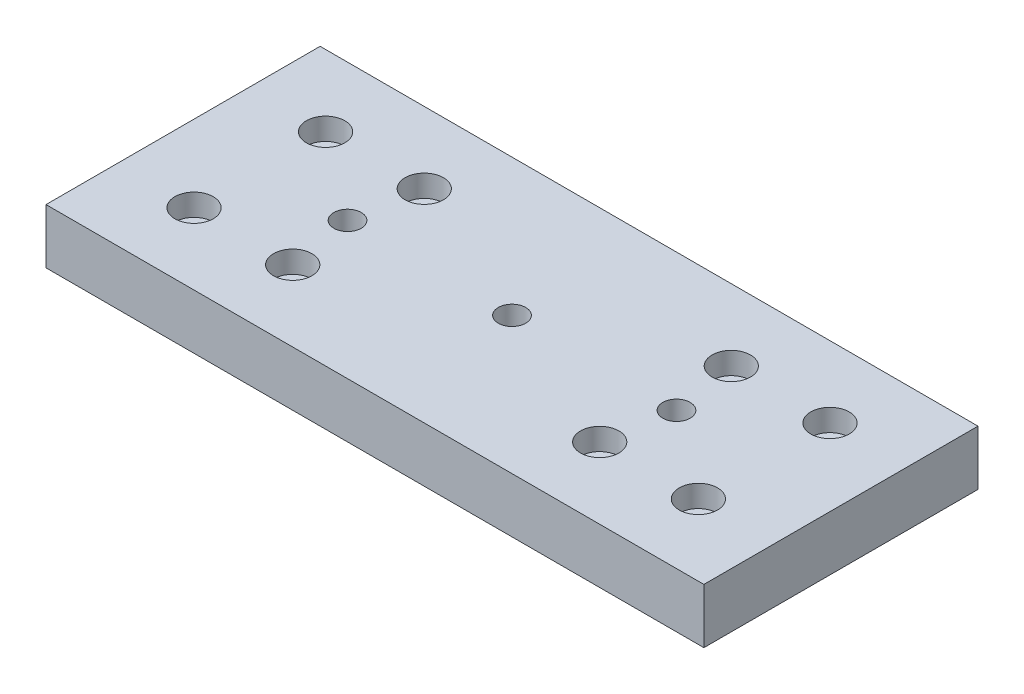
ISO-10303-21;
HEADER;
FILE_DESCRIPTION(('STEP AP214'),'2;1');
FILE_NAME('part.step','',(''),(''),'','','');
FILE_SCHEMA(('AUTOMOTIVE_DESIGN { 1 0 10303 214 1 1 1 1 }'));
ENDSEC;
DATA;
#1=APPLICATION_CONTEXT('core data for automotive mechanical design processes');
#2=APPLICATION_PROTOCOL_DEFINITION('international standard','automotive_design',2000,#1);
#3=PRODUCT_CONTEXT('',#1,'mechanical');
#4=PRODUCT('Part','Part','',(#3));
#5=PRODUCT_RELATED_PRODUCT_CATEGORY('part','',(#4));
#6=PRODUCT_DEFINITION_FORMATION('','',#4);
#7=PRODUCT_DEFINITION_CONTEXT('part definition',#1,'design');
#8=PRODUCT_DEFINITION('design','',#6,#7);
#9=PRODUCT_DEFINITION_SHAPE('','',#8);
#10=(LENGTH_UNIT() NAMED_UNIT(*) SI_UNIT(.MILLI.,.METRE.));
#11=(NAMED_UNIT(*) PLANE_ANGLE_UNIT() SI_UNIT($,.RADIAN.));
#12=(NAMED_UNIT(*) SI_UNIT($,.STERADIAN.) SOLID_ANGLE_UNIT());
#13=UNCERTAINTY_MEASURE_WITH_UNIT(LENGTH_MEASURE(1.E-05),#10,'distance_accuracy_value','');
#14=(GEOMETRIC_REPRESENTATION_CONTEXT(3) GLOBAL_UNCERTAINTY_ASSIGNED_CONTEXT((#13)) GLOBAL_UNIT_ASSIGNED_CONTEXT((#10,
#11,#12)) REPRESENTATION_CONTEXT('',''));
#15=CARTESIAN_POINT('',(0.,0.,0.));
#16=DIRECTION('',(0.,0.,1.));
#17=DIRECTION('',(1.,0.,0.));
#18=AXIS2_PLACEMENT_3D('',#15,#16,#17);
#19=CARTESIAN_POINT('',(-45.9999999999994,0.,-11.9999999999998));
#20=DIRECTION('',(0.,1.,0.));
#21=DIRECTION('',(0.,0.,1.));
#22=AXIS2_PLACEMENT_3D('',#19,#20,#21);
#23=CYLINDRICAL_SURFACE('',#22,1.5);
#24=CARTESIAN_POINT('',(-45.9999999999994,0.,-11.9999999999998));
#25=DIRECTION('',(0.,1.,0.));
#26=DIRECTION('',(0.,0.,1.));
#27=AXIS2_PLACEMENT_3D('',#24,#25,#26);
#28=CIRCLE('',#27,1.5);
#29=CARTESIAN_POINT('',(-45.9999999999994,0.,-10.4999999999998));
#30=VERTEX_POINT('',#29);
#31=EDGE_CURVE('E171',#30,#30,#28,.T.);
#32=ORIENTED_EDGE('',*,*,#31,.F.);
#33=EDGE_LOOP('',(#32));
#34=FACE_BOUND('',#33,.T.);
#35=CARTESIAN_POINT('',(-45.9999999999994,6.,-11.9999999999998));
#36=DIRECTION('',(0.,1.,0.));
#37=DIRECTION('',(0.,0.,1.));
#38=AXIS2_PLACEMENT_3D('',#35,#36,#37);
#39=CIRCLE('',#38,1.5);
#40=CARTESIAN_POINT('',(-45.9999999999994,6.,-10.4999999999998));
#41=VERTEX_POINT('',#40);
#42=EDGE_CURVE('E141',#41,#41,#39,.F.);
#43=ORIENTED_EDGE('',*,*,#42,.F.);
#44=EDGE_LOOP('',(#43));
#45=FACE_BOUND('',#44,.T.);
#46=ADVANCED_FACE('F36',(#34,#45),#23,.F.);
#47=CARTESIAN_POINT('',(-27.9999999999994,0.,-11.9999999999998));
#48=DIRECTION('',(0.,1.,0.));
#49=DIRECTION('',(0.,0.,1.));
#50=AXIS2_PLACEMENT_3D('',#47,#48,#49);
#51=CYLINDRICAL_SURFACE('',#50,1.5);
#52=CARTESIAN_POINT('',(-27.9999999999994,0.,-11.9999999999998));
#53=DIRECTION('',(0.,1.,0.));
#54=DIRECTION('',(0.,0.,1.));
#55=AXIS2_PLACEMENT_3D('',#52,#53,#54);
#56=CIRCLE('',#55,1.5);
#57=CARTESIAN_POINT('',(-27.9999999999994,0.,-10.4999999999998));
#58=VERTEX_POINT('',#57);
#59=EDGE_CURVE('E167',#58,#58,#56,.T.);
#60=ORIENTED_EDGE('',*,*,#59,.F.);
#61=EDGE_LOOP('',(#60));
#62=FACE_BOUND('',#61,.T.);
#63=CARTESIAN_POINT('',(-27.9999999999994,6.,-11.9999999999998));
#64=DIRECTION('',(0.,1.,0.));
#65=DIRECTION('',(0.,0.,1.));
#66=AXIS2_PLACEMENT_3D('',#63,#64,#65);
#67=CIRCLE('',#66,1.5);
#68=CARTESIAN_POINT('',(-27.9999999999994,6.,-10.4999999999998));
#69=VERTEX_POINT('',#68);
#70=EDGE_CURVE('E136',#69,#69,#67,.F.);
#71=ORIENTED_EDGE('',*,*,#70,.F.);
#72=EDGE_LOOP('',(#71));
#73=FACE_BOUND('',#72,.T.);
#74=ADVANCED_FACE('F211',(#62,#73),#51,.F.);
#75=CARTESIAN_POINT('',(45.9999999999994,0.,11.9999999999999));
#76=DIRECTION('',(0.,1.,0.));
#77=DIRECTION('',(0.,0.,1.));
#78=AXIS2_PLACEMENT_3D('',#75,#76,#77);
#79=CYLINDRICAL_SURFACE('',#78,1.5);
#80=CARTESIAN_POINT('',(45.9999999999994,0.,11.9999999999999));
#81=DIRECTION('',(0.,1.,0.));
#82=DIRECTION('',(0.,0.,1.));
#83=AXIS2_PLACEMENT_3D('',#80,#81,#82);
#84=CIRCLE('',#83,1.5);
#85=CARTESIAN_POINT('',(45.9999999999994,0.,13.4999999999998));
#86=VERTEX_POINT('',#85);
#87=EDGE_CURVE('E183',#86,#86,#84,.T.);
#88=ORIENTED_EDGE('',*,*,#87,.F.);
#89=EDGE_LOOP('',(#88));
#90=FACE_BOUND('',#89,.T.);
#91=CARTESIAN_POINT('',(45.9999999999994,6.,11.9999999999999));
#92=DIRECTION('',(0.,1.,0.));
#93=DIRECTION('',(0.,0.,1.));
#94=AXIS2_PLACEMENT_3D('',#91,#92,#93);
#95=CIRCLE('',#94,1.5);
#96=CARTESIAN_POINT('',(45.9999999999994,6.,13.4999999999998));
#97=VERTEX_POINT('',#96);
#98=EDGE_CURVE('E130',#97,#97,#95,.F.);
#99=ORIENTED_EDGE('',*,*,#98,.F.);
#100=EDGE_LOOP('',(#99));
#101=FACE_BOUND('',#100,.T.);
#102=ADVANCED_FACE('F218',(#90,#101),#79,.F.);
#103=CARTESIAN_POINT('',(27.9999999999994,0.,11.9999999999999));
#104=DIRECTION('',(0.,1.,0.));
#105=DIRECTION('',(0.,0.,1.));
#106=AXIS2_PLACEMENT_3D('',#103,#104,#105);
#107=CYLINDRICAL_SURFACE('',#106,1.5);
#108=CARTESIAN_POINT('',(27.9999999999994,0.,11.9999999999999));
#109=DIRECTION('',(0.,1.,0.));
#110=DIRECTION('',(0.,0.,1.));
#111=AXIS2_PLACEMENT_3D('',#108,#109,#110);
#112=CIRCLE('',#111,1.5);
#113=CARTESIAN_POINT('',(27.9999999999994,0.,13.4999999999999));
#114=VERTEX_POINT('',#113);
#115=EDGE_CURVE('E180',#114,#114,#112,.T.);
#116=ORIENTED_EDGE('',*,*,#115,.F.);
#117=EDGE_LOOP('',(#116));
#118=FACE_BOUND('',#117,.T.);
#119=CARTESIAN_POINT('',(27.9999999999994,6.,11.9999999999999));
#120=DIRECTION('',(0.,1.,0.));
#121=DIRECTION('',(0.,0.,1.));
#122=AXIS2_PLACEMENT_3D('',#119,#120,#121);
#123=CIRCLE('',#122,1.5);
#124=CARTESIAN_POINT('',(27.9999999999994,6.,13.4999999999999));
#125=VERTEX_POINT('',#124);
#126=EDGE_CURVE('E126',#125,#125,#123,.F.);
#127=ORIENTED_EDGE('',*,*,#126,.F.);
#128=EDGE_LOOP('',(#127));
#129=FACE_BOUND('',#128,.T.);
#130=ADVANCED_FACE('F230',(#118,#129),#107,.F.);
#131=CARTESIAN_POINT('',(0.,10.,0.));
#132=DIRECTION('',(0.,-1.,0.));
#133=DIRECTION('',(0.,0.,-1.));
#134=AXIS2_PLACEMENT_3D('',#131,#132,#133);
#135=CYLINDRICAL_SURFACE('',#134,2.5);
#136=CARTESIAN_POINT('',(0.,10.,0.));
#137=DIRECTION('',(0.,-1.,0.));
#138=DIRECTION('',(0.,0.,-1.));
#139=AXIS2_PLACEMENT_3D('',#136,#137,#138);
#140=CIRCLE('',#139,2.5);
#141=CARTESIAN_POINT('',(0.,10.,-2.5));
#142=VERTEX_POINT('',#141);
#143=EDGE_CURVE('E162',#142,#142,#140,.T.);
#144=ORIENTED_EDGE('',*,*,#143,.F.);
#145=EDGE_LOOP('',(#144));
#146=FACE_BOUND('',#145,.T.);
#147=CARTESIAN_POINT('',(0.,5.,0.));
#148=DIRECTION('',(0.,-1.,0.));
#149=DIRECTION('',(0.,0.,-1.));
#150=AXIS2_PLACEMENT_3D('',#147,#148,#149);
#151=CIRCLE('',#150,2.5);
#152=CARTESIAN_POINT('',(0.,5.,-2.5));
#153=VERTEX_POINT('',#152);
#154=EDGE_CURVE('E119',#153,#153,#151,.F.);
#155=ORIENTED_EDGE('',*,*,#154,.F.);
#156=EDGE_LOOP('',(#155));
#157=FACE_BOUND('',#156,.T.);
#158=ADVANCED_FACE('F233',(#146,#157),#135,.F.);
#159=CARTESIAN_POINT('',(29.9999999999984,10.,0.));
#160=DIRECTION('',(0.,-1.,0.));
#161=DIRECTION('',(0.,0.,-1.));
#162=AXIS2_PLACEMENT_3D('',#159,#160,#161);
#163=CYLINDRICAL_SURFACE('',#162,2.5);
#164=CARTESIAN_POINT('',(29.9999999999984,10.,0.));
#165=DIRECTION('',(0.,-1.,0.));
#166=DIRECTION('',(0.,0.,-1.));
#167=AXIS2_PLACEMENT_3D('',#164,#165,#166);
#168=CIRCLE('',#167,2.5);
#169=CARTESIAN_POINT('',(29.9999999999984,10.,-2.5));
#170=VERTEX_POINT('',#169);
#171=EDGE_CURVE('E159',#170,#170,#168,.T.);
#172=ORIENTED_EDGE('',*,*,#171,.F.);
#173=EDGE_LOOP('',(#172));
#174=FACE_BOUND('',#173,.T.);
#175=CARTESIAN_POINT('',(29.9999999999984,5.,0.));
#176=DIRECTION('',(0.,-1.,0.));
#177=DIRECTION('',(0.,0.,-1.));
#178=AXIS2_PLACEMENT_3D('',#175,#176,#177);
#179=CIRCLE('',#178,2.5);
#180=CARTESIAN_POINT('',(29.9999999999984,5.,-2.5));
#181=VERTEX_POINT('',#180);
#182=EDGE_CURVE('E115',#181,#181,#179,.F.);
#183=ORIENTED_EDGE('',*,*,#182,.F.);
#184=EDGE_LOOP('',(#183));
#185=FACE_BOUND('',#184,.T.);
#186=ADVANCED_FACE('F316',(#174,#185),#163,.F.);
#187=CARTESIAN_POINT('',(-30.,10.,0.));
#188=DIRECTION('',(0.,-1.,0.));
#189=DIRECTION('',(0.,0.,-1.));
#190=AXIS2_PLACEMENT_3D('',#187,#188,#189);
#191=CYLINDRICAL_SURFACE('',#190,2.5);
#192=CARTESIAN_POINT('',(-30.,10.,0.));
#193=DIRECTION('',(0.,-1.,0.));
#194=DIRECTION('',(0.,0.,-1.));
#195=AXIS2_PLACEMENT_3D('',#192,#193,#194);
#196=CIRCLE('',#195,2.5);
#197=CARTESIAN_POINT('',(-30.,10.,-2.5));
#198=VERTEX_POINT('',#197);
#199=EDGE_CURVE('E122',#198,#198,#196,.T.);
#200=ORIENTED_EDGE('',*,*,#199,.F.);
#201=EDGE_LOOP('',(#200));
#202=FACE_BOUND('',#201,.T.);
#203=CARTESIAN_POINT('',(-30.,5.,0.));
#204=DIRECTION('',(0.,-1.,0.));
#205=DIRECTION('',(0.,0.,-1.));
#206=AXIS2_PLACEMENT_3D('',#203,#204,#205);
#207=CIRCLE('',#206,2.5);
#208=CARTESIAN_POINT('',(-30.,5.,-2.5));
#209=VERTEX_POINT('',#208);
#210=EDGE_CURVE('E112',#209,#209,#207,.F.);
#211=ORIENTED_EDGE('',*,*,#210,.F.);
#212=EDGE_LOOP('',(#211));
#213=FACE_BOUND('',#212,.T.);
#214=ADVANCED_FACE('F319',(#202,#213),#191,.F.);
#215=CARTESIAN_POINT('',(-60.,10.,25.));
#216=DIRECTION('',(1.,0.,0.));
#217=DIRECTION('',(0.,0.,-1.));
#218=AXIS2_PLACEMENT_3D('',#215,#216,#217);
#219=PLANE('',#218);
#220=DIRECTION('',(0.,0.,1.));
#221=VECTOR('',#220,1.);
#222=CARTESIAN_POINT('',(-60.,0.,25.));
#223=LINE('',#222,#221);
#224=CARTESIAN_POINT('',(-60.,0.,-25.));
#225=VERTEX_POINT('',#224);
#226=CARTESIAN_POINT('',(-60.,0.,25.));
#227=VERTEX_POINT('',#226);
#228=EDGE_CURVE('E103',#225,#227,#223,.T.);
#229=ORIENTED_EDGE('',*,*,#228,.T.);
#230=DIRECTION('',(0.,-1.,0.));
#231=VECTOR('',#230,1.);
#232=CARTESIAN_POINT('',(-60.,10.,25.));
#233=LINE('',#232,#231);
#234=CARTESIAN_POINT('',(-60.,10.,25.));
#235=VERTEX_POINT('',#234);
#236=EDGE_CURVE('E11',#235,#227,#233,.T.);
#237=ORIENTED_EDGE('',*,*,#236,.F.);
#238=DIRECTION('',(0.,0.,1.));
#239=VECTOR('',#238,1.);
#240=CARTESIAN_POINT('',(-60.,10.,25.));
#241=LINE('',#240,#239);
#242=CARTESIAN_POINT('',(-60.,10.,-25.));
#243=VERTEX_POINT('',#242);
#244=EDGE_CURVE('E90',#243,#235,#241,.T.);
#245=ORIENTED_EDGE('',*,*,#244,.F.);
#246=DIRECTION('',(0.,-1.,0.));
#247=VECTOR('',#246,1.);
#248=CARTESIAN_POINT('',(-60.,10.,-25.));
#249=LINE('',#248,#247);
#250=EDGE_CURVE('E99',#243,#225,#249,.T.);
#251=ORIENTED_EDGE('',*,*,#250,.T.);
#252=EDGE_LOOP('',(#229,#237,#245,#251));
#253=FACE_BOUND('',#252,.T.);
#254=ADVANCED_FACE('F38',(#253),#219,.F.);
#255=CARTESIAN_POINT('',(60.,10.,25.));
#256=DIRECTION('',(0.,0.,-1.));
#257=DIRECTION('',(-1.,0.,0.));
#258=AXIS2_PLACEMENT_3D('',#255,#256,#257);
#259=PLANE('',#258);
#260=DIRECTION('',(1.,0.,0.));
#261=VECTOR('',#260,1.);
#262=CARTESIAN_POINT('',(60.,0.,25.));
#263=LINE('',#262,#261);
#264=CARTESIAN_POINT('',(60.,0.,25.));
#265=VERTEX_POINT('',#264);
#266=EDGE_CURVE('E94',#227,#265,#263,.T.);
#267=ORIENTED_EDGE('',*,*,#266,.T.);
#268=DIRECTION('',(0.,-1.,0.));
#269=VECTOR('',#268,1.);
#270=CARTESIAN_POINT('',(60.,10.,25.));
#271=LINE('',#270,#269);
#272=CARTESIAN_POINT('',(60.,10.,25.));
#273=VERTEX_POINT('',#272);
#274=EDGE_CURVE('E46',#273,#265,#271,.T.);
#275=ORIENTED_EDGE('',*,*,#274,.F.);
#276=DIRECTION('',(1.,0.,0.));
#277=VECTOR('',#276,1.);
#278=CARTESIAN_POINT('',(60.,10.,25.));
#279=LINE('',#278,#277);
#280=EDGE_CURVE('E85',#235,#273,#279,.T.);
#281=ORIENTED_EDGE('',*,*,#280,.F.);
#282=ORIENTED_EDGE('',*,*,#236,.T.);
#283=EDGE_LOOP('',(#267,#275,#281,#282));
#284=FACE_BOUND('',#283,.T.);
#285=ADVANCED_FACE('F93',(#284),#259,.F.);
#286=CARTESIAN_POINT('',(60.,10.,25.));
#287=DIRECTION('',(-1.,0.,0.));
#288=DIRECTION('',(0.,0.,1.));
#289=AXIS2_PLACEMENT_3D('',#286,#287,#288);
#290=PLANE('',#289);
#291=DIRECTION('',(0.,0.,-1.));
#292=VECTOR('',#291,1.);
#293=CARTESIAN_POINT('',(60.,0.,25.));
#294=LINE('',#293,#292);
#295=CARTESIAN_POINT('',(60.,0.,-25.));
#296=VERTEX_POINT('',#295);
#297=EDGE_CURVE('E72',#265,#296,#294,.T.);
#298=ORIENTED_EDGE('',*,*,#297,.T.);
#299=DIRECTION('',(0.,-1.,0.));
#300=VECTOR('',#299,1.);
#301=CARTESIAN_POINT('',(60.,10.,-25.));
#302=LINE('',#301,#300);
#303=CARTESIAN_POINT('',(60.,10.,-25.));
#304=VERTEX_POINT('',#303);
#305=EDGE_CURVE('E95',#304,#296,#302,.T.);
#306=ORIENTED_EDGE('',*,*,#305,.F.);
#307=DIRECTION('',(0.,0.,-1.));
#308=VECTOR('',#307,1.);
#309=CARTESIAN_POINT('',(60.,10.,25.));
#310=LINE('',#309,#308);
#311=EDGE_CURVE('E88',#273,#304,#310,.T.);
#312=ORIENTED_EDGE('',*,*,#311,.F.);
#313=ORIENTED_EDGE('',*,*,#274,.T.);
#314=EDGE_LOOP('',(#298,#306,#312,#313));
#315=FACE_BOUND('',#314,.T.);
#316=ADVANCED_FACE('F97',(#315),#290,.F.);
#317=CARTESIAN_POINT('',(60.,10.,-25.));
#318=DIRECTION('',(0.,0.,1.));
#319=DIRECTION('',(1.,0.,0.));
#320=AXIS2_PLACEMENT_3D('',#317,#318,#319);
#321=PLANE('',#320);
#322=DIRECTION('',(-1.,0.,0.));
#323=VECTOR('',#322,1.);
#324=CARTESIAN_POINT('',(60.,0.,-25.));
#325=LINE('',#324,#323);
#326=EDGE_CURVE('E78',#296,#225,#325,.T.);
#327=ORIENTED_EDGE('',*,*,#326,.T.);
#328=ORIENTED_EDGE('',*,*,#250,.F.);
#329=DIRECTION('',(-1.,0.,0.));
#330=VECTOR('',#329,1.);
#331=CARTESIAN_POINT('',(60.,10.,-25.));
#332=LINE('',#331,#330);
#333=EDGE_CURVE('E55',#304,#243,#332,.T.);
#334=ORIENTED_EDGE('',*,*,#333,.F.);
#335=ORIENTED_EDGE('',*,*,#305,.T.);
#336=EDGE_LOOP('',(#327,#328,#334,#335));
#337=FACE_BOUND('',#336,.T.);
#338=ADVANCED_FACE('F333',(#337),#321,.F.);
#339=CARTESIAN_POINT('',(0.,10.,0.));
#340=DIRECTION('',(0.,1.,0.));
#341=DIRECTION('',(0.,0.,1.));
#342=AXIS2_PLACEMENT_3D('',#339,#340,#341);
#343=PLANE('',#342);
#344=CARTESIAN_POINT('',(45.9999999999994,10.,11.9999999999999));
#345=DIRECTION('',(0.,1.,0.));
#346=DIRECTION('',(0.,0.,1.));
#347=AXIS2_PLACEMENT_3D('',#344,#345,#346);
#348=CIRCLE('',#347,3.50000000000001);
#349=CARTESIAN_POINT('',(45.9999999999994,10.,15.4999999999999));
#350=VERTEX_POINT('',#349);
#351=EDGE_CURVE('E585',#350,#350,#348,.T.);
#352=ORIENTED_EDGE('',*,*,#351,.F.);
#353=EDGE_LOOP('',(#352));
#354=FACE_BOUND('',#353,.T.);
#355=CARTESIAN_POINT('',(-45.9999999999994,10.,11.9999999999998));
#356=DIRECTION('',(0.,1.,0.));
#357=DIRECTION('',(0.,0.,-1.));
#358=AXIS2_PLACEMENT_3D('',#355,#356,#357);
#359=CIRCLE('',#358,3.5);
#360=CARTESIAN_POINT('',(-45.9999999999994,10.,8.49999999999978));
#361=VERTEX_POINT('',#360);
#362=EDGE_CURVE('E579',#361,#361,#359,.T.);
#363=ORIENTED_EDGE('',*,*,#362,.F.);
#364=EDGE_LOOP('',(#363));
#365=FACE_BOUND('',#364,.T.);
#366=CARTESIAN_POINT('',(-27.9999999999994,10.,11.9999999999998));
#367=DIRECTION('',(0.,1.,0.));
#368=DIRECTION('',(0.,0.,-1.));
#369=AXIS2_PLACEMENT_3D('',#366,#367,#368);
#370=CIRCLE('',#369,3.5);
#371=CARTESIAN_POINT('',(-27.9999999999994,10.,8.49999999999984));
#372=VERTEX_POINT('',#371);
#373=EDGE_CURVE('E578',#372,#372,#370,.T.);
#374=ORIENTED_EDGE('',*,*,#373,.F.);
#375=EDGE_LOOP('',(#374));
#376=FACE_BOUND('',#375,.T.);
#377=CARTESIAN_POINT('',(-27.9999999999994,10.,-11.9999999999998));
#378=DIRECTION('',(0.,1.,0.));
#379=DIRECTION('',(0.,0.,1.));
#380=AXIS2_PLACEMENT_3D('',#377,#378,#379);
#381=CIRCLE('',#380,3.5);
#382=CARTESIAN_POINT('',(-27.9999999999994,10.,-8.49999999999983));
#383=VERTEX_POINT('',#382);
#384=EDGE_CURVE('E592',#383,#383,#381,.T.);
#385=ORIENTED_EDGE('',*,*,#384,.F.);
#386=EDGE_LOOP('',(#385));
#387=FACE_BOUND('',#386,.T.);
#388=CARTESIAN_POINT('',(27.9999999999994,10.,11.9999999999999));
#389=DIRECTION('',(0.,1.,0.));
#390=DIRECTION('',(0.,0.,1.));
#391=AXIS2_PLACEMENT_3D('',#388,#389,#390);
#392=CIRCLE('',#391,3.5);
#393=CARTESIAN_POINT('',(27.9999999999994,10.,15.4999999999999));
#394=VERTEX_POINT('',#393);
#395=EDGE_CURVE('E566',#394,#394,#392,.T.);
#396=ORIENTED_EDGE('',*,*,#395,.F.);
#397=EDGE_LOOP('',(#396));
#398=FACE_BOUND('',#397,.T.);
#399=CARTESIAN_POINT('',(27.9999999999994,10.,-11.9999999999998));
#400=DIRECTION('',(0.,1.,0.));
#401=DIRECTION('',(0.,0.,-1.));
#402=AXIS2_PLACEMENT_3D('',#399,#400,#401);
#403=CIRCLE('',#402,3.5);
#404=CARTESIAN_POINT('',(27.9999999999994,10.,-15.4999999999998));
#405=VERTEX_POINT('',#404);
#406=EDGE_CURVE('E562',#405,#405,#403,.T.);
#407=ORIENTED_EDGE('',*,*,#406,.F.);
#408=EDGE_LOOP('',(#407));
#409=FACE_BOUND('',#408,.T.);
#410=CARTESIAN_POINT('',(45.9999999999994,10.,-11.9999999999997));
#411=DIRECTION('',(0.,1.,0.));
#412=DIRECTION('',(0.,0.,-1.));
#413=AXIS2_PLACEMENT_3D('',#410,#411,#412);
#414=CIRCLE('',#413,3.49999999999999);
#415=CARTESIAN_POINT('',(45.9999999999994,10.,-15.4999999999997));
#416=VERTEX_POINT('',#415);
#417=EDGE_CURVE('E569',#416,#416,#414,.T.);
#418=ORIENTED_EDGE('',*,*,#417,.F.);
#419=EDGE_LOOP('',(#418));
#420=FACE_BOUND('',#419,.T.);
#421=CARTESIAN_POINT('',(-45.9999999999994,10.,-11.9999999999998));
#422=DIRECTION('',(0.,1.,0.));
#423=DIRECTION('',(0.,0.,1.));
#424=AXIS2_PLACEMENT_3D('',#421,#422,#423);
#425=CIRCLE('',#424,3.5);
#426=CARTESIAN_POINT('',(-45.9999999999994,10.,-8.49999999999977));
#427=VERTEX_POINT('',#426);
#428=EDGE_CURVE('E591',#427,#427,#425,.T.);
#429=ORIENTED_EDGE('',*,*,#428,.F.);
#430=EDGE_LOOP('',(#429));
#431=FACE_BOUND('',#430,.T.);
#432=ORIENTED_EDGE('',*,*,#199,.T.);
#433=EDGE_LOOP('',(#432));
#434=FACE_BOUND('',#433,.T.);
#435=ORIENTED_EDGE('',*,*,#171,.T.);
#436=EDGE_LOOP('',(#435));
#437=FACE_BOUND('',#436,.T.);
#438=ORIENTED_EDGE('',*,*,#143,.T.);
#439=EDGE_LOOP('',(#438));
#440=FACE_BOUND('',#439,.T.);
#441=ORIENTED_EDGE('',*,*,#244,.T.);
#442=ORIENTED_EDGE('',*,*,#280,.T.);
#443=ORIENTED_EDGE('',*,*,#311,.T.);
#444=ORIENTED_EDGE('',*,*,#333,.T.);
#445=EDGE_LOOP('',(#441,#442,#443,#444));
#446=FACE_BOUND('',#445,.T.);
#447=ADVANCED_FACE('F86',(#354,#365,#376,#387,#398,#409,#420,#431,#434,#437,#440,#446),#343,.T.);
#448=CARTESIAN_POINT('',(0.,0.,0.));
#449=DIRECTION('',(0.,1.,0.));
#450=DIRECTION('',(0.,0.,1.));
#451=AXIS2_PLACEMENT_3D('',#448,#449,#450);
#452=PLANE('',#451);
#453=CARTESIAN_POINT('',(29.9999999999984,0.,0.));
#454=DIRECTION('',(0.,-1.,0.));
#455=DIRECTION('',(0.,0.,-1.));
#456=AXIS2_PLACEMENT_3D('',#453,#454,#455);
#457=CIRCLE('',#456,4.25);
#458=CARTESIAN_POINT('',(29.9999999999984,0.,-4.25));
#459=VERTEX_POINT('',#458);
#460=EDGE_CURVE('E606',#459,#459,#457,.T.);
#461=ORIENTED_EDGE('',*,*,#460,.F.);
#462=EDGE_LOOP('',(#461));
#463=FACE_BOUND('',#462,.T.);
#464=CARTESIAN_POINT('',(0.,0.,0.));
#465=DIRECTION('',(0.,-1.,0.));
#466=DIRECTION('',(0.,0.,-1.));
#467=AXIS2_PLACEMENT_3D('',#464,#465,#466);
#468=CIRCLE('',#467,4.25);
#469=CARTESIAN_POINT('',(0.,0.,-4.25));
#470=VERTEX_POINT('',#469);
#471=EDGE_CURVE('E155',#470,#470,#468,.T.);
#472=ORIENTED_EDGE('',*,*,#471,.F.);
#473=EDGE_LOOP('',(#472));
#474=FACE_BOUND('',#473,.T.);
#475=CARTESIAN_POINT('',(-30.,0.,0.));
#476=DIRECTION('',(0.,-1.,0.));
#477=DIRECTION('',(0.,0.,-1.));
#478=AXIS2_PLACEMENT_3D('',#475,#476,#477);
#479=CIRCLE('',#478,4.25);
#480=CARTESIAN_POINT('',(-30.,0.,-4.25));
#481=VERTEX_POINT('',#480);
#482=EDGE_CURVE('E146',#481,#481,#479,.T.);
#483=ORIENTED_EDGE('',*,*,#482,.F.);
#484=EDGE_LOOP('',(#483));
#485=FACE_BOUND('',#484,.T.);
#486=CARTESIAN_POINT('',(-45.9999999999994,0.,11.9999999999998));
#487=DIRECTION('',(0.,1.,0.));
#488=DIRECTION('',(0.,0.,-1.));
#489=AXIS2_PLACEMENT_3D('',#486,#487,#488);
#490=CIRCLE('',#489,1.5);
#491=CARTESIAN_POINT('',(-45.9999999999994,0.,10.4999999999998));
#492=VERTEX_POINT('',#491);
#493=EDGE_CURVE('E177',#492,#492,#490,.T.);
#494=ORIENTED_EDGE('',*,*,#493,.T.);
#495=EDGE_LOOP('',(#494));
#496=FACE_BOUND('',#495,.T.);
#497=ORIENTED_EDGE('',*,*,#115,.T.);
#498=EDGE_LOOP('',(#497));
#499=FACE_BOUND('',#498,.T.);
#500=ORIENTED_EDGE('',*,*,#87,.T.);
#501=EDGE_LOOP('',(#500));
#502=FACE_BOUND('',#501,.T.);
#503=CARTESIAN_POINT('',(45.9999999999994,0.,-11.9999999999997));
#504=DIRECTION('',(0.,1.,0.));
#505=DIRECTION('',(0.,0.,-1.));
#506=AXIS2_PLACEMENT_3D('',#503,#504,#505);
#507=CIRCLE('',#506,1.50000000000001);
#508=CARTESIAN_POINT('',(45.9999999999994,0.,-13.4999999999997));
#509=VERTEX_POINT('',#508);
#510=EDGE_CURVE('E174',#509,#509,#507,.T.);
#511=ORIENTED_EDGE('',*,*,#510,.T.);
#512=EDGE_LOOP('',(#511));
#513=FACE_BOUND('',#512,.T.);
#514=ORIENTED_EDGE('',*,*,#59,.T.);
#515=EDGE_LOOP('',(#514));
#516=FACE_BOUND('',#515,.T.);
#517=CARTESIAN_POINT('',(27.9999999999994,0.,-11.9999999999998));
#518=DIRECTION('',(0.,1.,0.));
#519=DIRECTION('',(0.,0.,-1.));
#520=AXIS2_PLACEMENT_3D('',#517,#518,#519);
#521=CIRCLE('',#520,1.5);
#522=CARTESIAN_POINT('',(27.9999999999994,0.,-13.4999999999998));
#523=VERTEX_POINT('',#522);
#524=EDGE_CURVE('E170',#523,#523,#521,.T.);
#525=ORIENTED_EDGE('',*,*,#524,.T.);
#526=EDGE_LOOP('',(#525));
#527=FACE_BOUND('',#526,.T.);
#528=ORIENTED_EDGE('',*,*,#31,.T.);
#529=EDGE_LOOP('',(#528));
#530=FACE_BOUND('',#529,.T.);
#531=CARTESIAN_POINT('',(-27.9999999999994,0.,11.9999999999998));
#532=DIRECTION('',(0.,1.,0.));
#533=DIRECTION('',(0.,0.,-1.));
#534=AXIS2_PLACEMENT_3D('',#531,#532,#533);
#535=CIRCLE('',#534,1.5);
#536=CARTESIAN_POINT('',(-27.9999999999994,0.,10.4999999999998));
#537=VERTEX_POINT('',#536);
#538=EDGE_CURVE('E106',#537,#537,#535,.T.);
#539=ORIENTED_EDGE('',*,*,#538,.T.);
#540=EDGE_LOOP('',(#539));
#541=FACE_BOUND('',#540,.T.);
#542=ORIENTED_EDGE('',*,*,#228,.F.);
#543=ORIENTED_EDGE('',*,*,#326,.F.);
#544=ORIENTED_EDGE('',*,*,#297,.F.);
#545=ORIENTED_EDGE('',*,*,#266,.F.);
#546=EDGE_LOOP('',(#542,#543,#544,#545));
#547=FACE_BOUND('',#546,.T.);
#548=ADVANCED_FACE('F191',(#463,#474,#485,#496,#499,#502,#513,#516,#527,#530,#541,#547),#452,.F.);
#549=CARTESIAN_POINT('',(-27.9999999999994,0.,11.9999999999998));
#550=DIRECTION('',(0.,1.,0.));
#551=DIRECTION('',(0.,0.,1.));
#552=AXIS2_PLACEMENT_3D('',#549,#550,#551);
#553=CYLINDRICAL_SURFACE('',#552,1.5);
#554=CARTESIAN_POINT('',(-27.9999999999994,6.,11.9999999999998));
#555=DIRECTION('',(0.,-1.,0.));
#556=DIRECTION('',(0.,0.,-1.));
#557=AXIS2_PLACEMENT_3D('',#554,#555,#556);
#558=CIRCLE('',#557,1.5);
#559=CARTESIAN_POINT('',(-27.9999999999994,6.,10.4999999999998));
#560=VERTEX_POINT('',#559);
#561=EDGE_CURVE('E40',#560,#560,#558,.F.);
#562=ORIENTED_EDGE('',*,*,#561,.T.);
#563=EDGE_LOOP('',(#562));
#564=FACE_BOUND('',#563,.T.);
#565=ORIENTED_EDGE('',*,*,#538,.F.);
#566=EDGE_LOOP('',(#565));
#567=FACE_BOUND('',#566,.T.);
#568=ADVANCED_FACE('F194',(#564,#567),#553,.F.);
#569=CARTESIAN_POINT('',(27.9999999999994,0.,-11.9999999999998));
#570=DIRECTION('',(0.,1.,0.));
#571=DIRECTION('',(0.,0.,1.));
#572=AXIS2_PLACEMENT_3D('',#569,#570,#571);
#573=CYLINDRICAL_SURFACE('',#572,1.5);
#574=CARTESIAN_POINT('',(27.9999999999994,6.,-11.9999999999998));
#575=DIRECTION('',(0.,-1.,0.));
#576=DIRECTION('',(0.,0.,-1.));
#577=AXIS2_PLACEMENT_3D('',#574,#575,#576);
#578=CIRCLE('',#577,1.5);
#579=CARTESIAN_POINT('',(27.9999999999994,6.,-13.4999999999998));
#580=VERTEX_POINT('',#579);
#581=EDGE_CURVE('E139',#580,#580,#578,.F.);
#582=ORIENTED_EDGE('',*,*,#581,.T.);
#583=EDGE_LOOP('',(#582));
#584=FACE_BOUND('',#583,.T.);
#585=ORIENTED_EDGE('',*,*,#524,.F.);
#586=EDGE_LOOP('',(#585));
#587=FACE_BOUND('',#586,.T.);
#588=ADVANCED_FACE('F196',(#584,#587),#573,.F.);
#589=CARTESIAN_POINT('',(45.9999999999994,0.,-11.9999999999997));
#590=DIRECTION('',(0.,1.,0.));
#591=DIRECTION('',(0.,0.,1.));
#592=AXIS2_PLACEMENT_3D('',#589,#590,#591);
#593=CYLINDRICAL_SURFACE('',#592,1.50000000000001);
#594=CARTESIAN_POINT('',(45.9999999999994,6.,-11.9999999999997));
#595=DIRECTION('',(0.,-1.,0.));
#596=DIRECTION('',(0.,0.,-1.));
#597=AXIS2_PLACEMENT_3D('',#594,#595,#596);
#598=CIRCLE('',#597,1.50000000000001);
#599=CARTESIAN_POINT('',(45.9999999999994,6.,-13.4999999999997));
#600=VERTEX_POINT('',#599);
#601=EDGE_CURVE('E133',#600,#600,#598,.F.);
#602=ORIENTED_EDGE('',*,*,#601,.T.);
#603=EDGE_LOOP('',(#602));
#604=FACE_BOUND('',#603,.T.);
#605=ORIENTED_EDGE('',*,*,#510,.F.);
#606=EDGE_LOOP('',(#605));
#607=FACE_BOUND('',#606,.T.);
#608=ADVANCED_FACE('F202',(#604,#607),#593,.F.);
#609=CARTESIAN_POINT('',(-45.9999999999994,0.,11.9999999999998));
#610=DIRECTION('',(0.,1.,0.));
#611=DIRECTION('',(0.,0.,1.));
#612=AXIS2_PLACEMENT_3D('',#609,#610,#611);
#613=CYLINDRICAL_SURFACE('',#612,1.5);
#614=CARTESIAN_POINT('',(-45.9999999999994,6.,11.9999999999998));
#615=DIRECTION('',(0.,-1.,0.));
#616=DIRECTION('',(0.,0.,-1.));
#617=AXIS2_PLACEMENT_3D('',#614,#615,#616);
#618=CIRCLE('',#617,1.5);
#619=CARTESIAN_POINT('',(-45.9999999999994,6.,10.4999999999998));
#620=VERTEX_POINT('',#619);
#621=EDGE_CURVE('E123',#620,#620,#618,.F.);
#622=ORIENTED_EDGE('',*,*,#621,.T.);
#623=EDGE_LOOP('',(#622));
#624=FACE_BOUND('',#623,.T.);
#625=ORIENTED_EDGE('',*,*,#493,.F.);
#626=EDGE_LOOP('',(#625));
#627=FACE_BOUND('',#626,.T.);
#628=ADVANCED_FACE('F225',(#624,#627),#613,.F.);
#629=CARTESIAN_POINT('',(-30.,5.,0.));
#630=DIRECTION('',(0.,-1.,0.));
#631=DIRECTION('',(0.,0.,-1.));
#632=AXIS2_PLACEMENT_3D('',#629,#630,#631);
#633=PLANE('',#632);
#634=CARTESIAN_POINT('',(-30.,5.,0.));
#635=DIRECTION('',(0.,-1.,0.));
#636=DIRECTION('',(0.,0.,-1.));
#637=AXIS2_PLACEMENT_3D('',#634,#635,#636);
#638=CIRCLE('',#637,4.25);
#639=CARTESIAN_POINT('',(-30.,5.,-4.25));
#640=VERTEX_POINT('',#639);
#641=EDGE_CURVE('E150',#640,#640,#638,.T.);
#642=ORIENTED_EDGE('',*,*,#641,.T.);
#643=EDGE_LOOP('',(#642));
#644=FACE_BOUND('',#643,.T.);
#645=ORIENTED_EDGE('',*,*,#210,.T.);
#646=EDGE_LOOP('',(#645));
#647=FACE_BOUND('',#646,.T.);
#648=ADVANCED_FACE('F228',(#644,#647),#633,.T.);
#649=CARTESIAN_POINT('',(-30.,5.,0.));
#650=DIRECTION('',(0.,-1.,0.));
#651=DIRECTION('',(0.,0.,-1.));
#652=AXIS2_PLACEMENT_3D('',#649,#650,#651);
#653=CYLINDRICAL_SURFACE('',#652,4.25);
#654=ORIENTED_EDGE('',*,*,#641,.F.);
#655=EDGE_LOOP('',(#654));
#656=FACE_BOUND('',#655,.T.);
#657=ORIENTED_EDGE('',*,*,#482,.T.);
#658=EDGE_LOOP('',(#657));
#659=FACE_BOUND('',#658,.T.);
#660=ADVANCED_FACE('F296',(#656,#659),#653,.F.);
#661=CARTESIAN_POINT('',(29.9999999999984,5.,0.));
#662=DIRECTION('',(0.,-1.,0.));
#663=DIRECTION('',(0.,0.,-1.));
#664=AXIS2_PLACEMENT_3D('',#661,#662,#663);
#665=PLANE('',#664);
#666=CARTESIAN_POINT('',(29.9999999999984,5.,0.));
#667=DIRECTION('',(0.,-1.,0.));
#668=DIRECTION('',(0.,0.,-1.));
#669=AXIS2_PLACEMENT_3D('',#666,#667,#668);
#670=CIRCLE('',#669,4.25);
#671=CARTESIAN_POINT('',(29.9999999999984,5.,-4.25));
#672=VERTEX_POINT('',#671);
#673=EDGE_CURVE('E116',#672,#672,#670,.T.);
#674=ORIENTED_EDGE('',*,*,#673,.T.);
#675=EDGE_LOOP('',(#674));
#676=FACE_BOUND('',#675,.T.);
#677=ORIENTED_EDGE('',*,*,#182,.T.);
#678=EDGE_LOOP('',(#677));
#679=FACE_BOUND('',#678,.T.);
#680=ADVANCED_FACE('F292',(#676,#679),#665,.T.);
#681=CARTESIAN_POINT('',(29.9999999999984,5.,0.));
#682=DIRECTION('',(0.,-1.,0.));
#683=DIRECTION('',(0.,0.,-1.));
#684=AXIS2_PLACEMENT_3D('',#681,#682,#683);
#685=CYLINDRICAL_SURFACE('',#684,4.25);
#686=ORIENTED_EDGE('',*,*,#673,.F.);
#687=EDGE_LOOP('',(#686));
#688=FACE_BOUND('',#687,.T.);
#689=ORIENTED_EDGE('',*,*,#460,.T.);
#690=EDGE_LOOP('',(#689));
#691=FACE_BOUND('',#690,.T.);
#692=ADVANCED_FACE('F295',(#688,#691),#685,.F.);
#693=CARTESIAN_POINT('',(0.,5.,0.));
#694=DIRECTION('',(0.,-1.,0.));
#695=DIRECTION('',(0.,0.,-1.));
#696=AXIS2_PLACEMENT_3D('',#693,#694,#695);
#697=PLANE('',#696);
#698=CARTESIAN_POINT('',(0.,5.,0.));
#699=DIRECTION('',(0.,-1.,0.));
#700=DIRECTION('',(0.,0.,-1.));
#701=AXIS2_PLACEMENT_3D('',#698,#699,#700);
#702=CIRCLE('',#701,4.25);
#703=CARTESIAN_POINT('',(0.,5.,-4.25));
#704=VERTEX_POINT('',#703);
#705=EDGE_CURVE('E609',#704,#704,#702,.T.);
#706=ORIENTED_EDGE('',*,*,#705,.T.);
#707=EDGE_LOOP('',(#706));
#708=FACE_BOUND('',#707,.T.);
#709=ORIENTED_EDGE('',*,*,#154,.T.);
#710=EDGE_LOOP('',(#709));
#711=FACE_BOUND('',#710,.T.);
#712=ADVANCED_FACE('F300',(#708,#711),#697,.T.);
#713=CARTESIAN_POINT('',(0.,5.,0.));
#714=DIRECTION('',(0.,-1.,0.));
#715=DIRECTION('',(0.,0.,-1.));
#716=AXIS2_PLACEMENT_3D('',#713,#714,#715);
#717=CYLINDRICAL_SURFACE('',#716,4.25);
#718=ORIENTED_EDGE('',*,*,#705,.F.);
#719=EDGE_LOOP('',(#718));
#720=FACE_BOUND('',#719,.T.);
#721=ORIENTED_EDGE('',*,*,#471,.T.);
#722=EDGE_LOOP('',(#721));
#723=FACE_BOUND('',#722,.T.);
#724=ADVANCED_FACE('F304',(#720,#723),#717,.F.);
#725=CARTESIAN_POINT('',(-45.9999999999994,6.,11.9999999999998));
#726=DIRECTION('',(0.,-1.,0.));
#727=DIRECTION('',(0.,0.,-1.));
#728=AXIS2_PLACEMENT_3D('',#725,#726,#727);
#729=PLANE('',#728);
#730=CARTESIAN_POINT('',(-45.9999999999994,6.,11.9999999999998));
#731=DIRECTION('',(0.,1.,0.));
#732=DIRECTION('',(0.,0.,-1.));
#733=AXIS2_PLACEMENT_3D('',#730,#731,#732);
#734=CIRCLE('',#733,3.5);
#735=CARTESIAN_POINT('',(-45.9999999999994,6.,8.49999999999978));
#736=VERTEX_POINT('',#735);
#737=EDGE_CURVE('E575',#736,#736,#734,.T.);
#738=ORIENTED_EDGE('',*,*,#737,.T.);
#739=EDGE_LOOP('',(#738));
#740=FACE_BOUND('',#739,.T.);
#741=ORIENTED_EDGE('',*,*,#621,.F.);
#742=EDGE_LOOP('',(#741));
#743=FACE_BOUND('',#742,.T.);
#744=ADVANCED_FACE('F308',(#740,#743),#729,.F.);
#745=CARTESIAN_POINT('',(-45.9999999999994,6.,11.9999999999998));
#746=DIRECTION('',(0.,1.,0.));
#747=DIRECTION('',(0.,0.,1.));
#748=AXIS2_PLACEMENT_3D('',#745,#746,#747);
#749=CYLINDRICAL_SURFACE('',#748,3.5);
#750=ORIENTED_EDGE('',*,*,#737,.F.);
#751=EDGE_LOOP('',(#750));
#752=FACE_BOUND('',#751,.T.);
#753=ORIENTED_EDGE('',*,*,#362,.T.);
#754=EDGE_LOOP('',(#753));
#755=FACE_BOUND('',#754,.T.);
#756=ADVANCED_FACE('F452',(#752,#755),#749,.F.);
#757=CARTESIAN_POINT('',(27.9999999999994,6.,11.9999999999999));
#758=DIRECTION('',(0.,1.,0.));
#759=DIRECTION('',(0.,0.,1.));
#760=AXIS2_PLACEMENT_3D('',#757,#758,#759);
#761=PLANE('',#760);
#762=CARTESIAN_POINT('',(27.9999999999994,6.,11.9999999999999));
#763=DIRECTION('',(0.,1.,0.));
#764=DIRECTION('',(0.,0.,1.));
#765=AXIS2_PLACEMENT_3D('',#762,#763,#764);
#766=CIRCLE('',#765,3.5);
#767=CARTESIAN_POINT('',(27.9999999999994,6.,15.4999999999999));
#768=VERTEX_POINT('',#767);
#769=EDGE_CURVE('E588',#768,#768,#766,.T.);
#770=ORIENTED_EDGE('',*,*,#769,.T.);
#771=EDGE_LOOP('',(#770));
#772=FACE_BOUND('',#771,.T.);
#773=ORIENTED_EDGE('',*,*,#126,.T.);
#774=EDGE_LOOP('',(#773));
#775=FACE_BOUND('',#774,.T.);
#776=ADVANCED_FACE('F459',(#772,#775),#761,.T.);
#777=CARTESIAN_POINT('',(27.9999999999994,6.,11.9999999999999));
#778=DIRECTION('',(0.,1.,0.));
#779=DIRECTION('',(0.,0.,1.));
#780=AXIS2_PLACEMENT_3D('',#777,#778,#779);
#781=CYLINDRICAL_SURFACE('',#780,3.5);
#782=ORIENTED_EDGE('',*,*,#769,.F.);
#783=EDGE_LOOP('',(#782));
#784=FACE_BOUND('',#783,.T.);
#785=ORIENTED_EDGE('',*,*,#395,.T.);
#786=EDGE_LOOP('',(#785));
#787=FACE_BOUND('',#786,.T.);
#788=ADVANCED_FACE('F467',(#784,#787),#781,.F.);
#789=CARTESIAN_POINT('',(45.9999999999994,6.,11.9999999999999));
#790=DIRECTION('',(0.,1.,0.));
#791=DIRECTION('',(0.,0.,1.));
#792=AXIS2_PLACEMENT_3D('',#789,#790,#791);
#793=PLANE('',#792);
#794=CARTESIAN_POINT('',(45.9999999999994,6.,11.9999999999999));
#795=DIRECTION('',(0.,1.,0.));
#796=DIRECTION('',(0.,0.,1.));
#797=AXIS2_PLACEMENT_3D('',#794,#795,#796);
#798=CIRCLE('',#797,3.50000000000001);
#799=CARTESIAN_POINT('',(45.9999999999994,6.,15.4999999999999));
#800=VERTEX_POINT('',#799);
#801=EDGE_CURVE('E582',#800,#800,#798,.T.);
#802=ORIENTED_EDGE('',*,*,#801,.T.);
#803=EDGE_LOOP('',(#802));
#804=FACE_BOUND('',#803,.T.);
#805=ORIENTED_EDGE('',*,*,#98,.T.);
#806=EDGE_LOOP('',(#805));
#807=FACE_BOUND('',#806,.T.);
#808=ADVANCED_FACE('F475',(#804,#807),#793,.T.);
#809=CARTESIAN_POINT('',(45.9999999999994,6.,11.9999999999999));
#810=DIRECTION('',(0.,1.,0.));
#811=DIRECTION('',(0.,0.,1.));
#812=AXIS2_PLACEMENT_3D('',#809,#810,#811);
#813=CYLINDRICAL_SURFACE('',#812,3.50000000000001);
#814=ORIENTED_EDGE('',*,*,#801,.F.);
#815=EDGE_LOOP('',(#814));
#816=FACE_BOUND('',#815,.T.);
#817=ORIENTED_EDGE('',*,*,#351,.T.);
#818=EDGE_LOOP('',(#817));
#819=FACE_BOUND('',#818,.T.);
#820=ADVANCED_FACE('F272',(#816,#819),#813,.F.);
#821=CARTESIAN_POINT('',(45.9999999999994,6.,-11.9999999999997));
#822=DIRECTION('',(0.,-1.,0.));
#823=DIRECTION('',(0.,0.,-1.));
#824=AXIS2_PLACEMENT_3D('',#821,#822,#823);
#825=PLANE('',#824);
#826=CARTESIAN_POINT('',(45.9999999999994,6.,-11.9999999999997));
#827=DIRECTION('',(0.,1.,0.));
#828=DIRECTION('',(0.,0.,-1.));
#829=AXIS2_PLACEMENT_3D('',#826,#827,#828);
#830=CIRCLE('',#829,3.49999999999999);
#831=CARTESIAN_POINT('',(45.9999999999994,6.,-15.4999999999997));
#832=VERTEX_POINT('',#831);
#833=EDGE_CURVE('E564',#832,#832,#830,.T.);
#834=ORIENTED_EDGE('',*,*,#833,.T.);
#835=EDGE_LOOP('',(#834));
#836=FACE_BOUND('',#835,.T.);
#837=ORIENTED_EDGE('',*,*,#601,.F.);
#838=EDGE_LOOP('',(#837));
#839=FACE_BOUND('',#838,.T.);
#840=ADVANCED_FACE('F267',(#836,#839),#825,.F.);
#841=CARTESIAN_POINT('',(45.9999999999994,6.,-11.9999999999997));
#842=DIRECTION('',(0.,1.,0.));
#843=DIRECTION('',(0.,0.,1.));
#844=AXIS2_PLACEMENT_3D('',#841,#842,#843);
#845=CYLINDRICAL_SURFACE('',#844,3.49999999999999);
#846=ORIENTED_EDGE('',*,*,#833,.F.);
#847=EDGE_LOOP('',(#846));
#848=FACE_BOUND('',#847,.T.);
#849=ORIENTED_EDGE('',*,*,#417,.T.);
#850=EDGE_LOOP('',(#849));
#851=FACE_BOUND('',#850,.T.);
#852=ADVANCED_FACE('F257',(#848,#851),#845,.F.);
#853=CARTESIAN_POINT('',(-27.9999999999994,6.,-11.9999999999998));
#854=DIRECTION('',(0.,1.,0.));
#855=DIRECTION('',(0.,0.,1.));
#856=AXIS2_PLACEMENT_3D('',#853,#854,#855);
#857=PLANE('',#856);
#858=CARTESIAN_POINT('',(-27.9999999999994,6.,-11.9999999999998));
#859=DIRECTION('',(0.,1.,0.));
#860=DIRECTION('',(0.,0.,1.));
#861=AXIS2_PLACEMENT_3D('',#858,#859,#860);
#862=CIRCLE('',#861,3.5);
#863=CARTESIAN_POINT('',(-27.9999999999994,6.,-8.49999999999983));
#864=VERTEX_POINT('',#863);
#865=EDGE_CURVE('E589',#864,#864,#862,.T.);
#866=ORIENTED_EDGE('',*,*,#865,.T.);
#867=EDGE_LOOP('',(#866));
#868=FACE_BOUND('',#867,.T.);
#869=ORIENTED_EDGE('',*,*,#70,.T.);
#870=EDGE_LOOP('',(#869));
#871=FACE_BOUND('',#870,.T.);
#872=ADVANCED_FACE('F254',(#868,#871),#857,.T.);
#873=CARTESIAN_POINT('',(-27.9999999999994,6.,-11.9999999999998));
#874=DIRECTION('',(0.,1.,0.));
#875=DIRECTION('',(0.,0.,1.));
#876=AXIS2_PLACEMENT_3D('',#873,#874,#875);
#877=CYLINDRICAL_SURFACE('',#876,3.5);
#878=ORIENTED_EDGE('',*,*,#865,.F.);
#879=EDGE_LOOP('',(#878));
#880=FACE_BOUND('',#879,.T.);
#881=ORIENTED_EDGE('',*,*,#384,.T.);
#882=EDGE_LOOP('',(#881));
#883=FACE_BOUND('',#882,.T.);
#884=ADVANCED_FACE('F256',(#880,#883),#877,.F.);
#885=CARTESIAN_POINT('',(27.9999999999994,6.,-11.9999999999998));
#886=DIRECTION('',(0.,-1.,0.));
#887=DIRECTION('',(0.,0.,-1.));
#888=AXIS2_PLACEMENT_3D('',#885,#886,#887);
#889=PLANE('',#888);
#890=CARTESIAN_POINT('',(27.9999999999994,6.,-11.9999999999998));
#891=DIRECTION('',(0.,1.,0.));
#892=DIRECTION('',(0.,0.,-1.));
#893=AXIS2_PLACEMENT_3D('',#890,#891,#892);
#894=CIRCLE('',#893,3.5);
#895=CARTESIAN_POINT('',(27.9999999999994,6.,-15.4999999999998));
#896=VERTEX_POINT('',#895);
#897=EDGE_CURVE('E559',#896,#896,#894,.T.);
#898=ORIENTED_EDGE('',*,*,#897,.T.);
#899=EDGE_LOOP('',(#898));
#900=FACE_BOUND('',#899,.T.);
#901=ORIENTED_EDGE('',*,*,#581,.F.);
#902=EDGE_LOOP('',(#901));
#903=FACE_BOUND('',#902,.T.);
#904=ADVANCED_FACE('F264',(#900,#903),#889,.F.);
#905=CARTESIAN_POINT('',(27.9999999999994,6.,-11.9999999999998));
#906=DIRECTION('',(0.,1.,0.));
#907=DIRECTION('',(0.,0.,1.));
#908=AXIS2_PLACEMENT_3D('',#905,#906,#907);
#909=CYLINDRICAL_SURFACE('',#908,3.5);
#910=ORIENTED_EDGE('',*,*,#897,.F.);
#911=EDGE_LOOP('',(#910));
#912=FACE_BOUND('',#911,.T.);
#913=ORIENTED_EDGE('',*,*,#406,.T.);
#914=EDGE_LOOP('',(#913));
#915=FACE_BOUND('',#914,.T.);
#916=ADVANCED_FACE('F287',(#912,#915),#909,.F.);
#917=CARTESIAN_POINT('',(-45.9999999999994,6.,-11.9999999999998));
#918=DIRECTION('',(0.,1.,0.));
#919=DIRECTION('',(0.,0.,1.));
#920=AXIS2_PLACEMENT_3D('',#917,#918,#919);
#921=PLANE('',#920);
#922=CARTESIAN_POINT('',(-45.9999999999994,6.,-11.9999999999998));
#923=DIRECTION('',(0.,1.,0.));
#924=DIRECTION('',(0.,0.,1.));
#925=AXIS2_PLACEMENT_3D('',#922,#923,#924);
#926=CIRCLE('',#925,3.5);
#927=CARTESIAN_POINT('',(-45.9999999999994,6.,-8.49999999999977));
#928=VERTEX_POINT('',#927);
#929=EDGE_CURVE('E127',#928,#928,#926,.T.);
#930=ORIENTED_EDGE('',*,*,#929,.T.);
#931=EDGE_LOOP('',(#930));
#932=FACE_BOUND('',#931,.T.);
#933=ORIENTED_EDGE('',*,*,#42,.T.);
#934=EDGE_LOOP('',(#933));
#935=FACE_BOUND('',#934,.T.);
#936=ADVANCED_FACE('F284',(#932,#935),#921,.T.);
#937=CARTESIAN_POINT('',(-45.9999999999994,6.,-11.9999999999998));
#938=DIRECTION('',(0.,1.,0.));
#939=DIRECTION('',(0.,0.,1.));
#940=AXIS2_PLACEMENT_3D('',#937,#938,#939);
#941=CYLINDRICAL_SURFACE('',#940,3.5);
#942=ORIENTED_EDGE('',*,*,#929,.F.);
#943=EDGE_LOOP('',(#942));
#944=FACE_BOUND('',#943,.T.);
#945=ORIENTED_EDGE('',*,*,#428,.T.);
#946=EDGE_LOOP('',(#945));
#947=FACE_BOUND('',#946,.T.);
#948=ADVANCED_FACE('F279',(#944,#947),#941,.F.);
#949=CARTESIAN_POINT('',(-27.9999999999994,6.,11.9999999999998));
#950=DIRECTION('',(0.,-1.,0.));
#951=DIRECTION('',(0.,0.,-1.));
#952=AXIS2_PLACEMENT_3D('',#949,#950,#951);
#953=PLANE('',#952);
#954=CARTESIAN_POINT('',(-27.9999999999994,6.,11.9999999999998));
#955=DIRECTION('',(0.,1.,0.));
#956=DIRECTION('',(0.,0.,-1.));
#957=AXIS2_PLACEMENT_3D('',#954,#955,#956);
#958=CIRCLE('',#957,3.5);
#959=CARTESIAN_POINT('',(-27.9999999999994,6.,8.49999999999984));
#960=VERTEX_POINT('',#959);
#961=EDGE_CURVE('E595',#960,#960,#958,.T.);
#962=ORIENTED_EDGE('',*,*,#961,.T.);
#963=EDGE_LOOP('',(#962));
#964=FACE_BOUND('',#963,.T.);
#965=ORIENTED_EDGE('',*,*,#561,.F.);
#966=EDGE_LOOP('',(#965));
#967=FACE_BOUND('',#966,.T.);
#968=ADVANCED_FACE('F275',(#964,#967),#953,.F.);
#969=CARTESIAN_POINT('',(-27.9999999999994,6.,11.9999999999998));
#970=DIRECTION('',(0.,1.,0.));
#971=DIRECTION('',(0.,0.,1.));
#972=AXIS2_PLACEMENT_3D('',#969,#970,#971);
#973=CYLINDRICAL_SURFACE('',#972,3.5);
#974=ORIENTED_EDGE('',*,*,#961,.F.);
#975=EDGE_LOOP('',(#974));
#976=FACE_BOUND('',#975,.T.);
#977=ORIENTED_EDGE('',*,*,#373,.T.);
#978=EDGE_LOOP('',(#977));
#979=FACE_BOUND('',#978,.T.);
#980=ADVANCED_FACE('F278',(#976,#979),#973,.F.);
#981=CLOSED_SHELL('',(#46,#74,#102,#130,#158,#186,#214,#254,#285,#316,#338,#447,#548,#568,#588,
#608,#628,#648,#660,#680,#692,#712,#724,#744,#756,#776,#788,#808,#820,#840,#852,#872,#884,#904,
#916,#936,#948,#968,#980));
#982=MANIFOLD_SOLID_BREP('B2',#981);
#983=ADVANCED_BREP_SHAPE_REPRESENTATION('',(#18,#982),#14);
#984=SHAPE_DEFINITION_REPRESENTATION(#9,#983);
ENDSEC;
END-ISO-10303-21;
